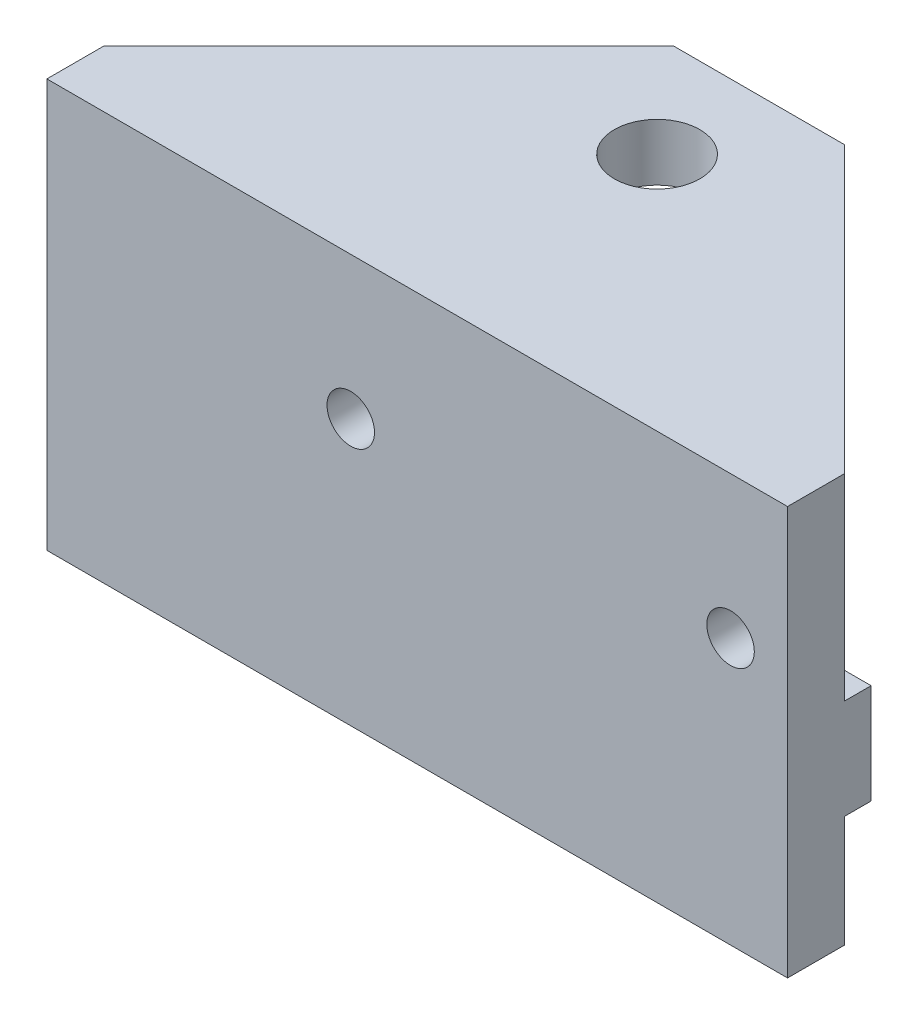
ISO-10303-21;
HEADER;
FILE_DESCRIPTION(('STEP AP214'),'2;1');
FILE_NAME('part.step','',(''),(''),'','','');
FILE_SCHEMA(('AUTOMOTIVE_DESIGN { 1 0 10303 214 1 1 1 1 }'));
ENDSEC;
DATA;
#1=APPLICATION_CONTEXT('core data for automotive mechanical design processes');
#2=APPLICATION_PROTOCOL_DEFINITION('international standard','automotive_design',2000,#1);
#3=PRODUCT_CONTEXT('',#1,'mechanical');
#4=PRODUCT('Part','Part','',(#3));
#5=PRODUCT_RELATED_PRODUCT_CATEGORY('part','',(#4));
#6=PRODUCT_DEFINITION_FORMATION('','',#4);
#7=PRODUCT_DEFINITION_CONTEXT('part definition',#1,'design');
#8=PRODUCT_DEFINITION('design','',#6,#7);
#9=PRODUCT_DEFINITION_SHAPE('','',#8);
#10=(LENGTH_UNIT() NAMED_UNIT(*) SI_UNIT(.MILLI.,.METRE.));
#11=(NAMED_UNIT(*) PLANE_ANGLE_UNIT() SI_UNIT($,.RADIAN.));
#12=(NAMED_UNIT(*) SI_UNIT($,.STERADIAN.) SOLID_ANGLE_UNIT());
#13=UNCERTAINTY_MEASURE_WITH_UNIT(LENGTH_MEASURE(1.E-05),#10,'distance_accuracy_value','');
#14=(GEOMETRIC_REPRESENTATION_CONTEXT(3) GLOBAL_UNCERTAINTY_ASSIGNED_CONTEXT((#13)) GLOBAL_UNIT_ASSIGNED_CONTEXT((#10,
#11,#12)) REPRESENTATION_CONTEXT('',''));
#15=CARTESIAN_POINT('',(0.,0.,0.));
#16=DIRECTION('',(0.,0.,1.));
#17=DIRECTION('',(1.,0.,0.));
#18=AXIS2_PLACEMENT_3D('',#15,#16,#17);
#19=CARTESIAN_POINT('',(0.,0.,0.));
#20=DIRECTION('',(0.,0.,-1.));
#21=DIRECTION('',(-1.,0.,0.));
#22=AXIS2_PLACEMENT_3D('',#19,#20,#21);
#23=PLANE('',#22);
#24=DIRECTION('',(0.,-1.,0.));
#25=VECTOR('',#24,1.);
#26=CARTESIAN_POINT('',(216.238481082402,7.02894022914576,0.));
#27=LINE('',#26,#25);
#28=CARTESIAN_POINT('',(216.238481082402,-5.60105977085423,0.));
#29=VERTEX_POINT('',#28);
#30=CARTESIAN_POINT('',(216.238481082402,-11.4710597708542,0.));
#31=VERTEX_POINT('',#30);
#32=EDGE_CURVE('E188',#29,#31,#27,.T.);
#33=ORIENTED_EDGE('',*,*,#32,.F.);
#34=DIRECTION('',(1.,0.,0.));
#35=VECTOR('',#34,1.);
#36=CARTESIAN_POINT('',(210.795356979462,-5.60105977085423,0.));
#37=LINE('',#36,#35);
#38=CARTESIAN_POINT('',(255.238481082402,-5.60105977085423,0.));
#39=VERTEX_POINT('',#38);
#40=EDGE_CURVE('E193',#29,#39,#37,.T.);
#41=ORIENTED_EDGE('',*,*,#40,.T.);
#42=DIRECTION('',(0.,1.,0.));
#43=VECTOR('',#42,1.);
#44=CARTESIAN_POINT('',(255.238481082402,7.02894022914577,0.));
#45=LINE('',#44,#43);
#46=CARTESIAN_POINT('',(255.238481082402,-11.4710597708542,0.));
#47=VERTEX_POINT('',#46);
#48=EDGE_CURVE('E221',#47,#39,#45,.T.);
#49=ORIENTED_EDGE('',*,*,#48,.F.);
#50=DIRECTION('',(1.,0.,0.));
#51=VECTOR('',#50,1.);
#52=CARTESIAN_POINT('',(255.238481082402,-11.4710597708542,0.));
#53=LINE('',#52,#51);
#54=EDGE_CURVE('E211',#31,#47,#53,.T.);
#55=ORIENTED_EDGE('',*,*,#54,.F.);
#56=EDGE_LOOP('',(#33,#41,#49,#55));
#57=FACE_BOUND('',#56,.T.);
#58=ADVANCED_FACE('F37',(#57),#23,.T.);
#59=CARTESIAN_POINT('',(255.238481082402,7.02894022914577,3.));
#60=DIRECTION('',(-1.,0.,0.));
#61=DIRECTION('',(0.,0.,1.));
#62=AXIS2_PLACEMENT_3D('',#59,#60,#61);
#63=PLANE('',#62);
#64=CARTESIAN_POINT('',(255.238481082402,-0.341059770854232,0.));
#65=VERTEX_POINT('',#64);
#66=CARTESIAN_POINT('',(255.238481082402,7.02894022914577,0.));
#67=VERTEX_POINT('',#66);
#68=EDGE_CURVE('E202',#65,#67,#45,.T.);
#69=ORIENTED_EDGE('',*,*,#68,.T.);
#70=DIRECTION('',(0.,1.,0.));
#71=VECTOR('',#70,1.);
#72=CARTESIAN_POINT('',(255.238481082402,7.02894022914577,0.));
#73=LINE('',#72,#71);
#74=CARTESIAN_POINT('',(255.238481082402,10.0289402291458,0.));
#75=VERTEX_POINT('',#74);
#76=EDGE_CURVE('E11',#67,#75,#73,.T.);
#77=ORIENTED_EDGE('',*,*,#76,.T.);
#78=DIRECTION('',(0.,0.,-1.));
#79=VECTOR('',#78,1.);
#80=CARTESIAN_POINT('',(255.238481082402,10.0289402291458,3.));
#81=LINE('',#80,#79);
#82=CARTESIAN_POINT('',(255.238481082402,10.0289402291458,3.));
#83=VERTEX_POINT('',#82);
#84=EDGE_CURVE('E151',#83,#75,#81,.T.);
#85=ORIENTED_EDGE('',*,*,#84,.F.);
#86=DIRECTION('',(0.,1.,0.));
#87=VECTOR('',#86,1.);
#88=CARTESIAN_POINT('',(255.238481082402,7.02894022914577,3.));
#89=LINE('',#88,#87);
#90=CARTESIAN_POINT('',(255.238481082402,-11.4710597708542,3.));
#91=VERTEX_POINT('',#90);
#92=EDGE_CURVE('E147',#91,#83,#89,.T.);
#93=ORIENTED_EDGE('',*,*,#92,.F.);
#94=DIRECTION('',(0.,0.,-1.));
#95=VECTOR('',#94,1.);
#96=CARTESIAN_POINT('',(255.238481082402,-11.4710597708542,3.));
#97=LINE('',#96,#95);
#98=EDGE_CURVE('E214',#91,#47,#97,.T.);
#99=ORIENTED_EDGE('',*,*,#98,.T.);
#100=ORIENTED_EDGE('',*,*,#48,.T.);
#101=DIRECTION('',(0.,0.,-1.));
#102=VECTOR('',#101,1.);
#103=CARTESIAN_POINT('',(255.238481082402,-5.60105977085423,0.));
#104=LINE('',#103,#102);
#105=CARTESIAN_POINT('',(255.238481082402,-5.60105977085423,-1.4));
#106=VERTEX_POINT('',#105);
#107=EDGE_CURVE('E171',#39,#106,#104,.T.);
#108=ORIENTED_EDGE('',*,*,#107,.T.);
#109=DIRECTION('',(0.,1.,0.));
#110=VECTOR('',#109,1.);
#111=CARTESIAN_POINT('',(255.238481082402,-0.341059770854232,-1.4));
#112=LINE('',#111,#110);
#113=CARTESIAN_POINT('',(255.238481082402,-0.341059770854232,-1.4));
#114=VERTEX_POINT('',#113);
#115=EDGE_CURVE('E176',#106,#114,#112,.T.);
#116=ORIENTED_EDGE('',*,*,#115,.T.);
#117=DIRECTION('',(0.,0.,1.));
#118=VECTOR('',#117,1.);
#119=CARTESIAN_POINT('',(255.238481082402,-0.341059770854232,0.));
#120=LINE('',#119,#118);
#121=EDGE_CURVE('E179',#114,#65,#120,.T.);
#122=ORIENTED_EDGE('',*,*,#121,.T.);
#123=EDGE_LOOP('',(#69,#77,#85,#93,#99,#100,#108,#116,#122));
#124=FACE_BOUND('',#123,.T.);
#125=ADVANCED_FACE('F270',(#124),#63,.F.);
#126=CARTESIAN_POINT('',(216.238481082402,7.02894022914576,3.));
#127=DIRECTION('',(1.,0.,0.));
#128=DIRECTION('',(0.,0.,-1.));
#129=AXIS2_PLACEMENT_3D('',#126,#127,#128);
#130=PLANE('',#129);
#131=DIRECTION('',(0.,0.,1.));
#132=VECTOR('',#131,1.);
#133=CARTESIAN_POINT('',(216.238481082402,10.0289402291458,3.));
#134=LINE('',#133,#132);
#135=CARTESIAN_POINT('',(216.238481082402,10.0289402291458,0.));
#136=VERTEX_POINT('',#135);
#137=CARTESIAN_POINT('',(216.238481082402,10.0289402291458,3.));
#138=VERTEX_POINT('',#137);
#139=EDGE_CURVE('E128',#136,#138,#134,.T.);
#140=ORIENTED_EDGE('',*,*,#139,.F.);
#141=DIRECTION('',(0.,-1.,0.));
#142=VECTOR('',#141,1.);
#143=CARTESIAN_POINT('',(216.238481082402,7.02894022914576,0.));
#144=LINE('',#143,#142);
#145=CARTESIAN_POINT('',(216.238481082402,7.02894022914576,0.));
#146=VERTEX_POINT('',#145);
#147=EDGE_CURVE('E226',#136,#146,#144,.T.);
#148=ORIENTED_EDGE('',*,*,#147,.T.);
#149=CARTESIAN_POINT('',(216.238481082402,-0.341059770854232,0.));
#150=VERTEX_POINT('',#149);
#151=EDGE_CURVE('E229',#146,#150,#27,.T.);
#152=ORIENTED_EDGE('',*,*,#151,.T.);
#153=DIRECTION('',(0.,0.,-1.));
#154=VECTOR('',#153,1.);
#155=CARTESIAN_POINT('',(216.238481082402,-0.341059770854232,0.));
#156=LINE('',#155,#154);
#157=CARTESIAN_POINT('',(216.238481082402,-0.341059770854232,-1.4));
#158=VERTEX_POINT('',#157);
#159=EDGE_CURVE('E174',#150,#158,#156,.T.);
#160=ORIENTED_EDGE('',*,*,#159,.T.);
#161=DIRECTION('',(0.,-1.,0.));
#162=VECTOR('',#161,1.);
#163=CARTESIAN_POINT('',(216.238481082402,-0.341059770854232,-1.4));
#164=LINE('',#163,#162);
#165=CARTESIAN_POINT('',(216.238481082402,-5.60105977085423,-1.4));
#166=VERTEX_POINT('',#165);
#167=EDGE_CURVE('E172',#158,#166,#164,.T.);
#168=ORIENTED_EDGE('',*,*,#167,.T.);
#169=DIRECTION('',(0.,0.,1.));
#170=VECTOR('',#169,1.);
#171=CARTESIAN_POINT('',(216.238481082402,-5.60105977085423,0.));
#172=LINE('',#171,#170);
#173=EDGE_CURVE('E197',#166,#29,#172,.T.);
#174=ORIENTED_EDGE('',*,*,#173,.T.);
#175=ORIENTED_EDGE('',*,*,#32,.T.);
#176=DIRECTION('',(0.,0.,-1.));
#177=VECTOR('',#176,1.);
#178=CARTESIAN_POINT('',(216.238481082402,-11.4710597708542,3.));
#179=LINE('',#178,#177);
#180=CARTESIAN_POINT('',(216.238481082402,-11.4710597708542,3.));
#181=VERTEX_POINT('',#180);
#182=EDGE_CURVE('E143',#181,#31,#179,.T.);
#183=ORIENTED_EDGE('',*,*,#182,.F.);
#184=DIRECTION('',(0.,-1.,0.));
#185=VECTOR('',#184,1.);
#186=CARTESIAN_POINT('',(216.238481082402,7.02894022914576,3.));
#187=LINE('',#186,#185);
#188=EDGE_CURVE('E140',#138,#181,#187,.T.);
#189=ORIENTED_EDGE('',*,*,#188,.F.);
#190=EDGE_LOOP('',(#140,#148,#152,#160,#168,#174,#175,#183,#189));
#191=FACE_BOUND('',#190,.T.);
#192=ADVANCED_FACE('F141',(#191),#130,.F.);
#193=CARTESIAN_POINT('',(255.238481082402,-11.4710597708542,3.));
#194=DIRECTION('',(0.,1.,0.));
#195=DIRECTION('',(-1.,0.,0.));
#196=AXIS2_PLACEMENT_3D('',#193,#194,#195);
#197=PLANE('',#196);
#198=ORIENTED_EDGE('',*,*,#54,.T.);
#199=ORIENTED_EDGE('',*,*,#98,.F.);
#200=DIRECTION('',(1.,0.,0.));
#201=VECTOR('',#200,1.);
#202=CARTESIAN_POINT('',(255.238481082402,-11.4710597708542,3.));
#203=LINE('',#202,#201);
#204=EDGE_CURVE('E146',#181,#91,#203,.T.);
#205=ORIENTED_EDGE('',*,*,#204,.F.);
#206=ORIENTED_EDGE('',*,*,#182,.T.);
#207=EDGE_LOOP('',(#198,#199,#205,#206));
#208=FACE_BOUND('',#207,.T.);
#209=ADVANCED_FACE('F293',(#208),#197,.F.);
#210=CARTESIAN_POINT('',(0.,0.,3.));
#211=DIRECTION('',(0.,0.,-1.));
#212=DIRECTION('',(-1.,0.,0.));
#213=AXIS2_PLACEMENT_3D('',#210,#211,#212);
#214=PLANE('',#213);
#215=CARTESIAN_POINT('',(232.238481082402,2.52894022914587,3.));
#216=DIRECTION('',(0.,0.,1.));
#217=DIRECTION('',(1.,0.,0.));
#218=AXIS2_PLACEMENT_3D('',#215,#216,#217);
#219=CIRCLE('',#218,1.25);
#220=CARTESIAN_POINT('',(233.488481082402,2.52894022914587,3.));
#221=VERTEX_POINT('',#220);
#222=EDGE_CURVE('E159',#221,#221,#219,.T.);
#223=ORIENTED_EDGE('',*,*,#222,.F.);
#224=EDGE_LOOP('',(#223));
#225=FACE_BOUND('',#224,.T.);
#226=CARTESIAN_POINT('',(252.238481082402,2.52894022914586,3.));
#227=DIRECTION('',(0.,0.,1.));
#228=DIRECTION('',(1.,0.,0.));
#229=AXIS2_PLACEMENT_3D('',#226,#227,#228);
#230=CIRCLE('',#229,1.24999999999997);
#231=CARTESIAN_POINT('',(253.488481082402,2.52894022914586,3.));
#232=VERTEX_POINT('',#231);
#233=EDGE_CURVE('E165',#232,#232,#230,.T.);
#234=ORIENTED_EDGE('',*,*,#233,.F.);
#235=EDGE_LOOP('',(#234));
#236=FACE_BOUND('',#235,.T.);
#237=ORIENTED_EDGE('',*,*,#92,.T.);
#238=DIRECTION('',(1.,0.,0.));
#239=VECTOR('',#238,1.);
#240=CARTESIAN_POINT('',(216.238481082402,10.0289402291458,3.));
#241=LINE('',#240,#239);
#242=EDGE_CURVE('E132',#138,#83,#241,.T.);
#243=ORIENTED_EDGE('',*,*,#242,.F.);
#244=ORIENTED_EDGE('',*,*,#188,.T.);
#245=ORIENTED_EDGE('',*,*,#204,.T.);
#246=EDGE_LOOP('',(#237,#243,#244,#245));
#247=FACE_BOUND('',#246,.T.);
#248=ADVANCED_FACE('F149',(#225,#236,#247),#214,.F.);
#249=CARTESIAN_POINT('',(232.238481082402,2.52894022914587,0.));
#250=DIRECTION('',(0.,0.,-1.));
#251=DIRECTION('',(-1.,0.,0.));
#252=AXIS2_PLACEMENT_3D('',#249,#250,#251);
#253=CIRCLE('',#252,1.25);
#254=CARTESIAN_POINT('',(230.988481082402,2.52894022914587,0.));
#255=VERTEX_POINT('',#254);
#256=EDGE_CURVE('E164',#255,#255,#253,.T.);
#257=ORIENTED_EDGE('',*,*,#256,.F.);
#258=EDGE_LOOP('',(#257));
#259=FACE_BOUND('',#258,.T.);
#260=CARTESIAN_POINT('',(252.238481082402,2.52894022914586,0.));
#261=DIRECTION('',(0.,0.,-1.));
#262=DIRECTION('',(-1.,0.,0.));
#263=AXIS2_PLACEMENT_3D('',#260,#261,#262);
#264=CIRCLE('',#263,1.24999999999997);
#265=CARTESIAN_POINT('',(250.988481082402,2.52894022914586,0.));
#266=VERTEX_POINT('',#265);
#267=EDGE_CURVE('E168',#266,#266,#264,.T.);
#268=ORIENTED_EDGE('',*,*,#267,.F.);
#269=EDGE_LOOP('',(#268));
#270=FACE_BOUND('',#269,.T.);
#271=DIRECTION('',(1.,0.,0.));
#272=VECTOR('',#271,1.);
#273=CARTESIAN_POINT('',(210.795356979462,-0.341059770854232,0.));
#274=LINE('',#273,#272);
#275=EDGE_CURVE('E175',#150,#65,#274,.T.);
#276=ORIENTED_EDGE('',*,*,#275,.F.);
#277=ORIENTED_EDGE('',*,*,#151,.F.);
#278=DIRECTION('',(-1.,0.,0.));
#279=VECTOR('',#278,1.);
#280=CARTESIAN_POINT('',(255.238481082402,7.02894022914577,0.));
#281=LINE('',#280,#279);
#282=EDGE_CURVE('E224',#67,#146,#281,.T.);
#283=ORIENTED_EDGE('',*,*,#282,.F.);
#284=ORIENTED_EDGE('',*,*,#68,.F.);
#285=EDGE_LOOP('',(#276,#277,#283,#284));
#286=FACE_BOUND('',#285,.T.);
#287=ADVANCED_FACE('F273',(#259,#270,#286),#23,.T.);
#288=CARTESIAN_POINT('',(210.795356979462,-0.341059770854232,0.));
#289=DIRECTION('',(0.,1.,0.));
#290=DIRECTION('',(0.,0.,1.));
#291=AXIS2_PLACEMENT_3D('',#288,#289,#290);
#292=PLANE('',#291);
#293=ORIENTED_EDGE('',*,*,#159,.F.);
#294=ORIENTED_EDGE('',*,*,#275,.T.);
#295=ORIENTED_EDGE('',*,*,#121,.F.);
#296=DIRECTION('',(1.,0.,0.));
#297=VECTOR('',#296,1.);
#298=CARTESIAN_POINT('',(210.795356979462,-0.341059770854232,-1.4));
#299=LINE('',#298,#297);
#300=EDGE_CURVE('E182',#158,#114,#299,.T.);
#301=ORIENTED_EDGE('',*,*,#300,.F.);
#302=EDGE_LOOP('',(#293,#294,#295,#301));
#303=FACE_BOUND('',#302,.T.);
#304=ADVANCED_FACE('F275',(#303),#292,.T.);
#305=CARTESIAN_POINT('',(210.795356979462,-0.341059770854232,-1.4));
#306=DIRECTION('',(0.,0.,-1.));
#307=DIRECTION('',(0.,1.,0.));
#308=AXIS2_PLACEMENT_3D('',#305,#306,#307);
#309=PLANE('',#308);
#310=ORIENTED_EDGE('',*,*,#167,.F.);
#311=ORIENTED_EDGE('',*,*,#300,.T.);
#312=ORIENTED_EDGE('',*,*,#115,.F.);
#313=DIRECTION('',(1.,0.,0.));
#314=VECTOR('',#313,1.);
#315=CARTESIAN_POINT('',(210.795356979462,-5.60105977085423,-1.4));
#316=LINE('',#315,#314);
#317=EDGE_CURVE('E207',#166,#106,#316,.T.);
#318=ORIENTED_EDGE('',*,*,#317,.F.);
#319=EDGE_LOOP('',(#310,#311,#312,#318));
#320=FACE_BOUND('',#319,.T.);
#321=ADVANCED_FACE('F280',(#320),#309,.T.);
#322=CARTESIAN_POINT('',(210.795356979462,-5.60105977085423,0.));
#323=DIRECTION('',(0.,-1.,0.));
#324=DIRECTION('',(0.,0.,-1.));
#325=AXIS2_PLACEMENT_3D('',#322,#323,#324);
#326=PLANE('',#325);
#327=ORIENTED_EDGE('',*,*,#173,.F.);
#328=ORIENTED_EDGE('',*,*,#317,.T.);
#329=ORIENTED_EDGE('',*,*,#107,.F.);
#330=ORIENTED_EDGE('',*,*,#40,.F.);
#331=EDGE_LOOP('',(#327,#328,#329,#330));
#332=FACE_BOUND('',#331,.T.);
#333=ADVANCED_FACE('F287',(#332),#326,.T.);
#334=CARTESIAN_POINT('',(252.238481082402,2.52894022914586,3.));
#335=DIRECTION('',(0.,0.,1.));
#336=DIRECTION('',(1.,0.,0.));
#337=AXIS2_PLACEMENT_3D('',#334,#335,#336);
#338=CYLINDRICAL_SURFACE('',#337,1.24999999999997);
#339=ORIENTED_EDGE('',*,*,#267,.T.);
#340=EDGE_LOOP('',(#339));
#341=FACE_BOUND('',#340,.T.);
#342=ORIENTED_EDGE('',*,*,#233,.T.);
#343=EDGE_LOOP('',(#342));
#344=FACE_BOUND('',#343,.T.);
#345=ADVANCED_FACE('F320',(#341,#344),#338,.F.);
#346=CARTESIAN_POINT('',(232.238481082402,2.52894022914587,3.));
#347=DIRECTION('',(0.,0.,1.));
#348=DIRECTION('',(1.,0.,0.));
#349=AXIS2_PLACEMENT_3D('',#346,#347,#348);
#350=CYLINDRICAL_SURFACE('',#349,1.25);
#351=ORIENTED_EDGE('',*,*,#256,.T.);
#352=EDGE_LOOP('',(#351));
#353=FACE_BOUND('',#352,.T.);
#354=ORIENTED_EDGE('',*,*,#222,.T.);
#355=EDGE_LOOP('',(#354));
#356=FACE_BOUND('',#355,.T.);
#357=ADVANCED_FACE('F323',(#353,#356),#350,.F.);
#358=CARTESIAN_POINT('',(216.238481082402,10.0289402291458,-15.));
#359=DIRECTION('',(0.,0.,1.));
#360=DIRECTION('',(1.,0.,0.));
#361=AXIS2_PLACEMENT_3D('',#358,#359,#360);
#362=PLANE('',#361);
#363=DIRECTION('',(-1.,0.,0.));
#364=VECTOR('',#363,1.);
#365=CARTESIAN_POINT('',(216.238481082402,7.02894022914576,-15.));
#366=LINE('',#365,#364);
#367=CARTESIAN_POINT('',(240.238481082402,7.02894022914577,-15.));
#368=VERTEX_POINT('',#367);
#369=CARTESIAN_POINT('',(231.238481082402,7.02894022914576,-15.));
#370=VERTEX_POINT('',#369);
#371=EDGE_CURVE('E137',#368,#370,#366,.T.);
#372=ORIENTED_EDGE('',*,*,#371,.T.);
#373=DIRECTION('',(0.,1.,0.));
#374=VECTOR('',#373,1.);
#375=CARTESIAN_POINT('',(231.238481082402,10.0289402291458,-15.));
#376=LINE('',#375,#374);
#377=CARTESIAN_POINT('',(231.238481082402,10.0289402291458,-15.));
#378=VERTEX_POINT('',#377);
#379=EDGE_CURVE('E63',#370,#378,#376,.T.);
#380=ORIENTED_EDGE('',*,*,#379,.T.);
#381=DIRECTION('',(-1.,0.,0.));
#382=VECTOR('',#381,1.);
#383=CARTESIAN_POINT('',(216.238481082402,10.0289402291458,-15.));
#384=LINE('',#383,#382);
#385=CARTESIAN_POINT('',(240.238481082402,10.0289402291458,-15.));
#386=VERTEX_POINT('',#385);
#387=EDGE_CURVE('E154',#386,#378,#384,.T.);
#388=ORIENTED_EDGE('',*,*,#387,.F.);
#389=DIRECTION('',(0.,-1.,0.));
#390=VECTOR('',#389,1.);
#391=CARTESIAN_POINT('',(240.238481082402,10.0289402291458,-15.));
#392=LINE('',#391,#390);
#393=EDGE_CURVE('E252',#386,#368,#392,.T.);
#394=ORIENTED_EDGE('',*,*,#393,.T.);
#395=EDGE_LOOP('',(#372,#380,#388,#394));
#396=FACE_BOUND('',#395,.T.);
#397=ADVANCED_FACE('F267',(#396),#362,.F.);
#398=CARTESIAN_POINT('',(0.,10.0289402291457,0.));
#399=DIRECTION('',(0.,-1.,0.));
#400=DIRECTION('',(1.,0.,0.));
#401=AXIS2_PLACEMENT_3D('',#398,#399,#400);
#402=PLANE('',#401);
#403=CARTESIAN_POINT('',(235.738481082402,10.0289402291458,-9.63000000000003));
#404=DIRECTION('',(0.,1.,0.));
#405=DIRECTION('',(0.,0.,1.));
#406=AXIS2_PLACEMENT_3D('',#403,#404,#405);
#407=CIRCLE('',#406,2.25);
#408=CARTESIAN_POINT('',(235.738481082402,10.0289402291458,-7.38000000000003));
#409=VERTEX_POINT('',#408);
#410=EDGE_CURVE('E441',#409,#409,#407,.T.);
#411=ORIENTED_EDGE('',*,*,#410,.F.);
#412=EDGE_LOOP('',(#411));
#413=FACE_BOUND('',#412,.T.);
#414=ORIENTED_EDGE('',*,*,#387,.T.);
#415=DIRECTION('',(0.707106781186548,0.,-0.707106781186547));
#416=VECTOR('',#415,1.);
#417=CARTESIAN_POINT('',(216.238481082402,10.0289402291458,0.));
#418=LINE('',#417,#416);
#419=EDGE_CURVE('E47',#378,#136,#418,.F.);
#420=ORIENTED_EDGE('',*,*,#419,.T.);
#421=ORIENTED_EDGE('',*,*,#139,.T.);
#422=ORIENTED_EDGE('',*,*,#242,.T.);
#423=ORIENTED_EDGE('',*,*,#84,.T.);
#424=DIRECTION('',(0.707106781186546,0.,0.707106781186549));
#425=VECTOR('',#424,1.);
#426=CARTESIAN_POINT('',(240.238481082402,10.0289402291458,-15.));
#427=LINE('',#426,#425);
#428=EDGE_CURVE('E260',#75,#386,#427,.F.);
#429=ORIENTED_EDGE('',*,*,#428,.T.);
#430=EDGE_LOOP('',(#414,#420,#421,#422,#423,#429));
#431=FACE_BOUND('',#430,.T.);
#432=ADVANCED_FACE('F130',(#413,#431),#402,.F.);
#433=CARTESIAN_POINT('',(0.,7.02894022914573,0.));
#434=DIRECTION('',(0.,-1.,0.));
#435=DIRECTION('',(1.,0.,0.));
#436=AXIS2_PLACEMENT_3D('',#433,#434,#435);
#437=PLANE('',#436);
#438=CARTESIAN_POINT('',(235.738481082402,7.02894022914577,-9.63000000000003));
#439=DIRECTION('',(0.,-1.,0.));
#440=DIRECTION('',(1.,0.,0.));
#441=AXIS2_PLACEMENT_3D('',#438,#439,#440);
#442=CIRCLE('',#441,2.24999999999999);
#443=CARTESIAN_POINT('',(237.988481082402,7.02894022914577,-9.63000000000003));
#444=VERTEX_POINT('',#443);
#445=EDGE_CURVE('E41',#444,#444,#442,.T.);
#446=ORIENTED_EDGE('',*,*,#445,.F.);
#447=EDGE_LOOP('',(#446));
#448=FACE_BOUND('',#447,.T.);
#449=ORIENTED_EDGE('',*,*,#282,.T.);
#450=DIRECTION('',(-0.707106781186548,0.,0.707106781186547));
#451=VECTOR('',#450,1.);
#452=CARTESIAN_POINT('',(108.119240541201,7.02894022914574,108.119240541201));
#453=LINE('',#452,#451);
#454=EDGE_CURVE('E247',#146,#370,#453,.F.);
#455=ORIENTED_EDGE('',*,*,#454,.T.);
#456=ORIENTED_EDGE('',*,*,#371,.F.);
#457=DIRECTION('',(-0.707106781186546,0.,-0.707106781186549));
#458=VECTOR('',#457,1.);
#459=CARTESIAN_POINT('',(127.619240541201,7.02894022914575,-127.619240541201));
#460=LINE('',#459,#458);
#461=EDGE_CURVE('E242',#368,#67,#460,.F.);
#462=ORIENTED_EDGE('',*,*,#461,.T.);
#463=EDGE_LOOP('',(#449,#455,#456,#462));
#464=FACE_BOUND('',#463,.T.);
#465=ADVANCED_FACE('F269',(#448,#464),#437,.T.);
#466=CARTESIAN_POINT('',(216.238481082402,7.02894022914576,0.));
#467=DIRECTION('',(0.707106781186547,0.,0.707106781186548));
#468=DIRECTION('',(0.,-1.,0.));
#469=AXIS2_PLACEMENT_3D('',#466,#467,#468);
#470=PLANE('',#469);
#471=ORIENTED_EDGE('',*,*,#419,.F.);
#472=ORIENTED_EDGE('',*,*,#379,.F.);
#473=ORIENTED_EDGE('',*,*,#454,.F.);
#474=ORIENTED_EDGE('',*,*,#147,.F.);
#475=EDGE_LOOP('',(#471,#472,#473,#474));
#476=FACE_BOUND('',#475,.T.);
#477=ADVANCED_FACE('F395',(#476),#470,.F.);
#478=CARTESIAN_POINT('',(240.238481082402,10.0289402291458,-15.));
#479=DIRECTION('',(-0.707106781186549,0.,0.707106781186546));
#480=DIRECTION('',(0.,-1.,0.));
#481=AXIS2_PLACEMENT_3D('',#478,#479,#480);
#482=PLANE('',#481);
#483=ORIENTED_EDGE('',*,*,#428,.F.);
#484=ORIENTED_EDGE('',*,*,#76,.F.);
#485=ORIENTED_EDGE('',*,*,#461,.F.);
#486=ORIENTED_EDGE('',*,*,#393,.F.);
#487=EDGE_LOOP('',(#483,#484,#485,#486));
#488=FACE_BOUND('',#487,.T.);
#489=ADVANCED_FACE('F39',(#488),#482,.F.);
#490=CARTESIAN_POINT('',(235.738481082402,10.0289402291458,-9.63000000000003));
#491=DIRECTION('',(0.,1.,0.));
#492=DIRECTION('',(0.,0.,1.));
#493=AXIS2_PLACEMENT_3D('',#490,#491,#492);
#494=CYLINDRICAL_SURFACE('',#493,2.24999999999999);
#495=ORIENTED_EDGE('',*,*,#445,.T.);
#496=EDGE_LOOP('',(#495));
#497=FACE_BOUND('',#496,.T.);
#498=ORIENTED_EDGE('',*,*,#410,.T.);
#499=EDGE_LOOP('',(#498));
#500=FACE_BOUND('',#499,.T.);
#501=ADVANCED_FACE('F410',(#497,#500),#494,.F.);
#502=CLOSED_SHELL('',(#58,#125,#192,#209,#248,#287,#304,#321,#333,#345,#357,#397,#432,#465,#477,
#489,#501));
#503=MANIFOLD_SOLID_BREP('B2',#502);
#504=ADVANCED_BREP_SHAPE_REPRESENTATION('',(#18,#503),#14);
#505=SHAPE_DEFINITION_REPRESENTATION(#9,#504);
ENDSEC;
END-ISO-10303-21;
